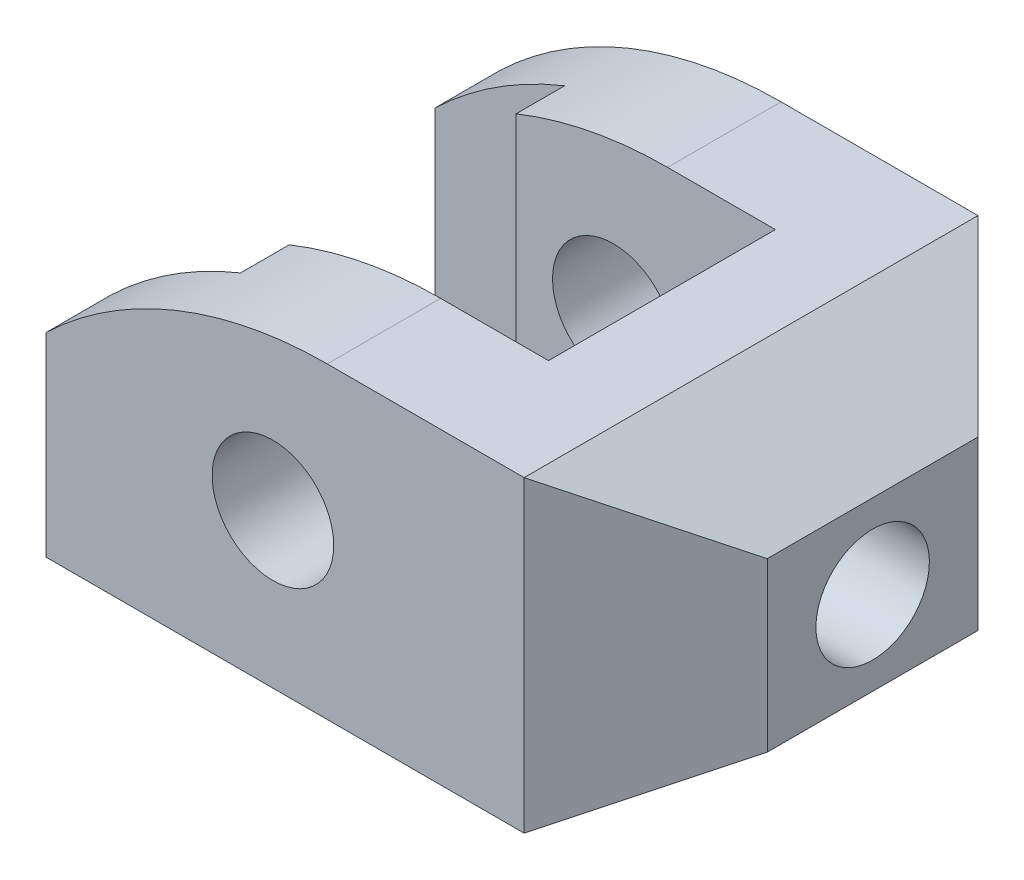
ISO-10303-21;
HEADER;
FILE_DESCRIPTION(('STEP AP214'),'2;1');
FILE_NAME('part.step','',(''),(''),'','','');
FILE_SCHEMA(('AUTOMOTIVE_DESIGN { 1 0 10303 214 1 1 1 1 }'));
ENDSEC;
DATA;
#1=APPLICATION_CONTEXT('core data for automotive mechanical design processes');
#2=APPLICATION_PROTOCOL_DEFINITION('international standard','automotive_design',2000,#1);
#3=PRODUCT_CONTEXT('',#1,'mechanical');
#4=PRODUCT('Part','Part','',(#3));
#5=PRODUCT_RELATED_PRODUCT_CATEGORY('part','',(#4));
#6=PRODUCT_DEFINITION_FORMATION('','',#4);
#7=PRODUCT_DEFINITION_CONTEXT('part definition',#1,'design');
#8=PRODUCT_DEFINITION('design','',#6,#7);
#9=PRODUCT_DEFINITION_SHAPE('','',#8);
#10=(LENGTH_UNIT() NAMED_UNIT(*) SI_UNIT(.MILLI.,.METRE.));
#11=(NAMED_UNIT(*) PLANE_ANGLE_UNIT() SI_UNIT($,.RADIAN.));
#12=(NAMED_UNIT(*) SI_UNIT($,.STERADIAN.) SOLID_ANGLE_UNIT());
#13=UNCERTAINTY_MEASURE_WITH_UNIT(LENGTH_MEASURE(1.E-05),#10,'distance_accuracy_value','');
#14=(GEOMETRIC_REPRESENTATION_CONTEXT(3) GLOBAL_UNCERTAINTY_ASSIGNED_CONTEXT((#13)) GLOBAL_UNIT_ASSIGNED_CONTEXT((#10,
#11,#12)) REPRESENTATION_CONTEXT('',''));
#15=CARTESIAN_POINT('',(0.,0.,0.));
#16=DIRECTION('',(0.,0.,1.));
#17=DIRECTION('',(1.,0.,0.));
#18=AXIS2_PLACEMENT_3D('',#15,#16,#17);
#19=CARTESIAN_POINT('',(-28.,-19.,56.));
#20=DIRECTION('',(1.,0.,0.));
#21=DIRECTION('',(0.,0.,-1.));
#22=AXIS2_PLACEMENT_3D('',#19,#20,#21);
#23=PLANE('',#22);
#24=DIRECTION('',(0.,0.,-1.));
#25=VECTOR('',#24,1.);
#26=CARTESIAN_POINT('',(-28.,-19.,56.));
#27=LINE('',#26,#25);
#28=CARTESIAN_POINT('',(-28.,-19.,8.));
#29=VERTEX_POINT('',#28);
#30=CARTESIAN_POINT('',(-28.,-19.,0.));
#31=VERTEX_POINT('',#30);
#32=EDGE_CURVE('E187',#29,#31,#27,.T.);
#33=ORIENTED_EDGE('',*,*,#32,.F.);
#34=DIRECTION('',(0.,1.,0.));
#35=VECTOR('',#34,1.);
#36=CARTESIAN_POINT('',(-28.,-81.4819974072532,8.));
#37=LINE('',#36,#35);
#38=CARTESIAN_POINT('',(-28.,5.,8.));
#39=VERTEX_POINT('',#38);
#40=EDGE_CURVE('E273',#29,#39,#37,.T.);
#41=ORIENTED_EDGE('',*,*,#40,.T.);
#42=DIRECTION('',(0.,0.,-1.));
#43=VECTOR('',#42,1.);
#44=CARTESIAN_POINT('',(-28.,4.99999999999999,56.));
#45=LINE('',#44,#43);
#46=CARTESIAN_POINT('',(-28.,4.99999999999999,0.));
#47=VERTEX_POINT('',#46);
#48=EDGE_CURVE('E252',#39,#47,#45,.T.);
#49=ORIENTED_EDGE('',*,*,#48,.T.);
#50=DIRECTION('',(0.,-1.,0.));
#51=VECTOR('',#50,1.);
#52=CARTESIAN_POINT('',(-28.,-19.,0.));
#53=LINE('',#52,#51);
#54=EDGE_CURVE('E244',#47,#31,#53,.T.);
#55=ORIENTED_EDGE('',*,*,#54,.T.);
#56=EDGE_LOOP('',(#33,#41,#49,#55));
#57=FACE_BOUND('',#56,.T.);
#58=ADVANCED_FACE('F40',(#57),#23,.F.);
#59=CARTESIAN_POINT('',(6.69870314579494,-31.,56.));
#60=DIRECTION('',(0.,0.,-1.));
#61=DIRECTION('',(-1.,0.,0.));
#62=AXIS2_PLACEMENT_3D('',#59,#60,#61);
#63=CYLINDRICAL_SURFACE('',#62,50.);
#64=ORIENTED_EDGE('',*,*,#48,.F.);
#65=CARTESIAN_POINT('',(6.69870314579494,-31.,8.));
#66=DIRECTION('',(0.,0.,-1.));
#67=DIRECTION('',(-1.,0.,0.));
#68=AXIS2_PLACEMENT_3D('',#65,#66,#67);
#69=CIRCLE('',#68,50.);
#70=CARTESIAN_POINT('',(-12.,15.3719581284362,8.));
#71=VERTEX_POINT('',#70);
#72=EDGE_CURVE('E212',#39,#71,#69,.T.);
#73=ORIENTED_EDGE('',*,*,#72,.T.);
#74=DIRECTION('',(0.,0.,-1.));
#75=VECTOR('',#74,1.);
#76=CARTESIAN_POINT('',(-12.,15.3719581284362,56.));
#77=LINE('',#76,#75);
#78=CARTESIAN_POINT('',(-12.,15.3719581284362,14.));
#79=VERTEX_POINT('',#78);
#80=EDGE_CURVE('E209',#71,#79,#77,.F.);
#81=ORIENTED_EDGE('',*,*,#80,.T.);
#82=CARTESIAN_POINT('',(6.69870314579494,-31.,14.));
#83=DIRECTION('',(0.,0.,-1.));
#84=DIRECTION('',(-1.,0.,0.));
#85=AXIS2_PLACEMENT_3D('',#82,#83,#84);
#86=CIRCLE('',#85,50.);
#87=CARTESIAN_POINT('',(6.69870314579496,19.,14.));
#88=VERTEX_POINT('',#87);
#89=EDGE_CURVE('E204',#79,#88,#86,.T.);
#90=ORIENTED_EDGE('',*,*,#89,.T.);
#91=DIRECTION('',(0.,0.,-1.));
#92=VECTOR('',#91,1.);
#93=CARTESIAN_POINT('',(6.69870314579495,19.,56.));
#94=LINE('',#93,#92);
#95=CARTESIAN_POINT('',(6.69870314579495,19.,0.));
#96=VERTEX_POINT('',#95);
#97=EDGE_CURVE('E251',#88,#96,#94,.T.);
#98=ORIENTED_EDGE('',*,*,#97,.T.);
#99=CARTESIAN_POINT('',(6.69870314579494,-31.,0.));
#100=DIRECTION('',(0.,0.,1.));
#101=DIRECTION('',(1.,0.,0.));
#102=AXIS2_PLACEMENT_3D('',#99,#100,#101);
#103=CIRCLE('',#102,50.);
#104=EDGE_CURVE('E241',#96,#47,#103,.T.);
#105=ORIENTED_EDGE('',*,*,#104,.T.);
#106=EDGE_LOOP('',(#64,#73,#81,#90,#98,#105));
#107=FACE_BOUND('',#106,.T.);
#108=ADVANCED_FACE('F260',(#107),#63,.T.);
#109=CARTESIAN_POINT('',(0.,0.,56.));
#110=DIRECTION('',(0.,0.,-1.));
#111=DIRECTION('',(-1.,0.,0.));
#112=AXIS2_PLACEMENT_3D('',#109,#110,#111);
#113=CYLINDRICAL_SURFACE('',#112,7.5);
#114=CARTESIAN_POINT('',(0.,0.,14.));
#115=DIRECTION('',(0.,0.,-1.));
#116=DIRECTION('',(-1.,0.,0.));
#117=AXIS2_PLACEMENT_3D('',#114,#115,#116);
#118=CIRCLE('',#117,7.5);
#119=CARTESIAN_POINT('',(-7.5,0.,14.));
#120=VERTEX_POINT('',#119);
#121=EDGE_CURVE('E201',#120,#120,#118,.T.);
#122=ORIENTED_EDGE('',*,*,#121,.F.);
#123=EDGE_LOOP('',(#122));
#124=FACE_BOUND('',#123,.T.);
#125=CARTESIAN_POINT('',(0.,0.,0.));
#126=DIRECTION('',(0.,0.,1.));
#127=DIRECTION('',(1.,0.,0.));
#128=AXIS2_PLACEMENT_3D('',#125,#126,#127);
#129=CIRCLE('',#128,7.5);
#130=CARTESIAN_POINT('',(7.5,0.,0.));
#131=VERTEX_POINT('',#130);
#132=EDGE_CURVE('E168',#131,#131,#129,.T.);
#133=ORIENTED_EDGE('',*,*,#132,.F.);
#134=EDGE_LOOP('',(#133));
#135=FACE_BOUND('',#134,.T.);
#136=ADVANCED_FACE('F361',(#124,#135),#113,.F.);
#137=CARTESIAN_POINT('',(6.69870314579494,-31.,56.));
#138=DIRECTION('',(0.,0.,1.));
#139=DIRECTION('',(1.,0.,0.));
#140=AXIS2_PLACEMENT_3D('',#137,#138,#139);
#141=PLANE('',#140);
#142=DIRECTION('',(0.,1.,0.));
#143=VECTOR('',#142,1.);
#144=CARTESIAN_POINT('',(31.,-81.4819974072532,56.));
#145=LINE('',#144,#143);
#146=CARTESIAN_POINT('',(31.,-19.,56.));
#147=VERTEX_POINT('',#146);
#148=CARTESIAN_POINT('',(31.,19.,56.));
#149=VERTEX_POINT('',#148);
#150=EDGE_CURVE('E150',#147,#149,#145,.T.);
#151=ORIENTED_EDGE('',*,*,#150,.T.);
#152=DIRECTION('',(-1.,0.,0.));
#153=VECTOR('',#152,1.);
#154=CARTESIAN_POINT('',(6.69870314579495,19.,56.));
#155=LINE('',#154,#153);
#156=CARTESIAN_POINT('',(6.69870314579495,19.,56.));
#157=VERTEX_POINT('',#156);
#158=EDGE_CURVE('E180',#149,#157,#155,.T.);
#159=ORIENTED_EDGE('',*,*,#158,.T.);
#160=CARTESIAN_POINT('',(6.69870314579494,-31.,56.));
#161=DIRECTION('',(0.,0.,1.));
#162=DIRECTION('',(1.,0.,0.));
#163=AXIS2_PLACEMENT_3D('',#160,#161,#162);
#164=CIRCLE('',#163,50.);
#165=CARTESIAN_POINT('',(-28.,4.99999999999999,56.));
#166=VERTEX_POINT('',#165);
#167=EDGE_CURVE('E302',#157,#166,#164,.T.);
#168=ORIENTED_EDGE('',*,*,#167,.T.);
#169=DIRECTION('',(0.,-1.,0.));
#170=VECTOR('',#169,1.);
#171=CARTESIAN_POINT('',(-28.,-19.,56.));
#172=LINE('',#171,#170);
#173=CARTESIAN_POINT('',(-28.,-19.,56.));
#174=VERTEX_POINT('',#173);
#175=EDGE_CURVE('E176',#166,#174,#172,.T.);
#176=ORIENTED_EDGE('',*,*,#175,.T.);
#177=DIRECTION('',(1.,0.,0.));
#178=VECTOR('',#177,1.);
#179=CARTESIAN_POINT('',(-28.,-19.,56.));
#180=LINE('',#179,#178);
#181=EDGE_CURVE('E172',#174,#147,#180,.T.);
#182=ORIENTED_EDGE('',*,*,#181,.T.);
#183=EDGE_LOOP('',(#151,#159,#168,#176,#182));
#184=FACE_BOUND('',#183,.T.);
#185=CARTESIAN_POINT('',(0.,0.,56.));
#186=DIRECTION('',(0.,0.,1.));
#187=DIRECTION('',(1.,0.,0.));
#188=AXIS2_PLACEMENT_3D('',#185,#186,#187);
#189=CIRCLE('',#188,7.5);
#190=CARTESIAN_POINT('',(7.5,0.,56.));
#191=VERTEX_POINT('',#190);
#192=EDGE_CURVE('E295',#191,#191,#189,.T.);
#193=ORIENTED_EDGE('',*,*,#192,.F.);
#194=EDGE_LOOP('',(#193));
#195=FACE_BOUND('',#194,.T.);
#196=ADVANCED_FACE('F173',(#184,#195),#141,.T.);
#197=CARTESIAN_POINT('',(6.69870314579494,-31.,0.));
#198=DIRECTION('',(0.,0.,1.));
#199=DIRECTION('',(1.,0.,0.));
#200=AXIS2_PLACEMENT_3D('',#197,#198,#199);
#201=PLANE('',#200);
#202=DIRECTION('',(-1.,0.,0.));
#203=VECTOR('',#202,1.);
#204=CARTESIAN_POINT('',(6.69870314579495,19.,0.));
#205=LINE('',#204,#203);
#206=CARTESIAN_POINT('',(31.,19.,0.));
#207=VERTEX_POINT('',#206);
#208=EDGE_CURVE('E229',#207,#96,#205,.T.);
#209=ORIENTED_EDGE('',*,*,#208,.F.);
#210=DIRECTION('',(0.,1.,0.));
#211=VECTOR('',#210,1.);
#212=CARTESIAN_POINT('',(31.,-81.4819974072532,0.));
#213=LINE('',#212,#211);
#214=CARTESIAN_POINT('',(31.,-19.,0.));
#215=VERTEX_POINT('',#214);
#216=EDGE_CURVE('E238',#215,#207,#213,.T.);
#217=ORIENTED_EDGE('',*,*,#216,.F.);
#218=DIRECTION('',(1.,0.,0.));
#219=VECTOR('',#218,1.);
#220=CARTESIAN_POINT('',(-28.,-19.,0.));
#221=LINE('',#220,#219);
#222=EDGE_CURVE('E186',#31,#215,#221,.T.);
#223=ORIENTED_EDGE('',*,*,#222,.F.);
#224=ORIENTED_EDGE('',*,*,#54,.F.);
#225=ORIENTED_EDGE('',*,*,#104,.F.);
#226=EDGE_LOOP('',(#209,#217,#223,#224,#225));
#227=FACE_BOUND('',#226,.T.);
#228=ORIENTED_EDGE('',*,*,#132,.T.);
#229=EDGE_LOOP('',(#228));
#230=FACE_BOUND('',#229,.T.);
#231=ADVANCED_FACE('F236',(#227,#230),#201,.F.);
#232=CARTESIAN_POINT('',(-28.,4.99999999999999,48.));
#233=VERTEX_POINT('',#232);
#234=EDGE_CURVE('E248',#166,#233,#45,.T.);
#235=ORIENTED_EDGE('',*,*,#234,.T.);
#236=DIRECTION('',(0.,1.,0.));
#237=VECTOR('',#236,1.);
#238=CARTESIAN_POINT('',(-28.,-81.4819974072532,48.));
#239=LINE('',#238,#237);
#240=CARTESIAN_POINT('',(-28.,-19.,48.));
#241=VERTEX_POINT('',#240);
#242=EDGE_CURVE('E62',#241,#233,#239,.T.);
#243=ORIENTED_EDGE('',*,*,#242,.F.);
#244=EDGE_CURVE('E189',#174,#241,#27,.T.);
#245=ORIENTED_EDGE('',*,*,#244,.F.);
#246=ORIENTED_EDGE('',*,*,#175,.F.);
#247=EDGE_LOOP('',(#235,#243,#245,#246));
#248=FACE_BOUND('',#247,.T.);
#249=ADVANCED_FACE('F42',(#248),#23,.F.);
#250=CARTESIAN_POINT('',(-28.,-19.,56.));
#251=DIRECTION('',(0.,1.,0.));
#252=DIRECTION('',(0.,0.,1.));
#253=AXIS2_PLACEMENT_3D('',#250,#251,#252);
#254=PLANE('',#253);
#255=DIRECTION('',(0.,0.,1.));
#256=VECTOR('',#255,1.);
#257=CARTESIAN_POINT('',(-12.,-19.,8.));
#258=LINE('',#257,#256);
#259=CARTESIAN_POINT('',(-12.,-19.,8.));
#260=VERTEX_POINT('',#259);
#261=CARTESIAN_POINT('',(-12.,-19.,14.));
#262=VERTEX_POINT('',#261);
#263=EDGE_CURVE('E279',#260,#262,#258,.T.);
#264=ORIENTED_EDGE('',*,*,#263,.F.);
#265=DIRECTION('',(1.,0.,0.));
#266=VECTOR('',#265,1.);
#267=CARTESIAN_POINT('',(-28.,-19.,8.));
#268=LINE('',#267,#266);
#269=EDGE_CURVE('E277',#29,#260,#268,.T.);
#270=ORIENTED_EDGE('',*,*,#269,.F.);
#271=ORIENTED_EDGE('',*,*,#32,.T.);
#272=ORIENTED_EDGE('',*,*,#222,.T.);
#273=DIRECTION('',(0.,0.,-1.));
#274=VECTOR('',#273,1.);
#275=CARTESIAN_POINT('',(31.,-19.,56.));
#276=LINE('',#275,#274);
#277=EDGE_CURVE('E165',#147,#215,#276,.T.);
#278=ORIENTED_EDGE('',*,*,#277,.F.);
#279=ORIENTED_EDGE('',*,*,#181,.F.);
#280=ORIENTED_EDGE('',*,*,#244,.T.);
#281=DIRECTION('',(-1.,0.,0.));
#282=VECTOR('',#281,1.);
#283=CARTESIAN_POINT('',(-28.,-19.,48.));
#284=LINE('',#283,#282);
#285=CARTESIAN_POINT('',(-12.,-19.,48.));
#286=VERTEX_POINT('',#285);
#287=EDGE_CURVE('E280',#286,#241,#284,.T.);
#288=ORIENTED_EDGE('',*,*,#287,.F.);
#289=DIRECTION('',(0.,0.,1.));
#290=VECTOR('',#289,1.);
#291=CARTESIAN_POINT('',(-12.,-19.,48.));
#292=LINE('',#291,#290);
#293=CARTESIAN_POINT('',(-12.,-19.,42.));
#294=VERTEX_POINT('',#293);
#295=EDGE_CURVE('E288',#294,#286,#292,.T.);
#296=ORIENTED_EDGE('',*,*,#295,.F.);
#297=DIRECTION('',(-1.,0.,0.));
#298=VECTOR('',#297,1.);
#299=CARTESIAN_POINT('',(-12.,-19.,42.));
#300=LINE('',#299,#298);
#301=CARTESIAN_POINT('',(20.,-19.,42.));
#302=VERTEX_POINT('',#301);
#303=EDGE_CURVE('E286',#302,#294,#300,.T.);
#304=ORIENTED_EDGE('',*,*,#303,.F.);
#305=DIRECTION('',(0.,0.,1.));
#306=VECTOR('',#305,1.);
#307=CARTESIAN_POINT('',(20.,-19.,14.));
#308=LINE('',#307,#306);
#309=CARTESIAN_POINT('',(20.,-19.,14.));
#310=VERTEX_POINT('',#309);
#311=EDGE_CURVE('E284',#310,#302,#308,.T.);
#312=ORIENTED_EDGE('',*,*,#311,.F.);
#313=DIRECTION('',(1.,0.,0.));
#314=VECTOR('',#313,1.);
#315=CARTESIAN_POINT('',(-12.,-19.,14.));
#316=LINE('',#315,#314);
#317=EDGE_CURVE('E282',#262,#310,#316,.T.);
#318=ORIENTED_EDGE('',*,*,#317,.F.);
#319=EDGE_LOOP('',(#264,#270,#271,#272,#278,#279,#280,#288,#296,#304,#312,#318));
#320=FACE_BOUND('',#319,.T.);
#321=ADVANCED_FACE('F184',(#320),#254,.F.);
#322=CARTESIAN_POINT('',(31.,-19.,56.));
#323=DIRECTION('',(-0.500000000000001,0.866025403784438,0.));
#324=DIRECTION('',(-0.866025403784438,-0.500000000000001,0.));
#325=AXIS2_PLACEMENT_3D('',#322,#323,#324);
#326=PLANE('',#325);
#327=DIRECTION('',(0.,0.,-1.));
#328=VECTOR('',#327,1.);
#329=CARTESIAN_POINT('',(46.,-10.3397459621556,56.));
#330=LINE('',#329,#328);
#331=CARTESIAN_POINT('',(46.,-10.3397459621556,41.0000000000002));
#332=VERTEX_POINT('',#331);
#333=CARTESIAN_POINT('',(46.,-10.3397459621556,14.9999999999998));
#334=VERTEX_POINT('',#333);
#335=EDGE_CURVE('E167',#332,#334,#330,.T.);
#336=ORIENTED_EDGE('',*,*,#335,.F.);
#337=DIRECTION('',(-0.65465367070798,-0.37796447300923,0.654653670707973));
#338=VECTOR('',#337,1.);
#339=CARTESIAN_POINT('',(31.,-19.,56.));
#340=LINE('',#339,#338);
#341=EDGE_CURVE('E153',#332,#147,#340,.T.);
#342=ORIENTED_EDGE('',*,*,#341,.T.);
#343=ORIENTED_EDGE('',*,*,#277,.T.);
#344=DIRECTION('',(0.65465367070798,0.37796447300923,0.654653670707973));
#345=VECTOR('',#344,1.);
#346=CARTESIAN_POINT('',(54.9999999999999,-5.14359353944897,23.9999999999997));
#347=LINE('',#346,#345);
#348=EDGE_CURVE('E169',#215,#334,#347,.T.);
#349=ORIENTED_EDGE('',*,*,#348,.T.);
#350=EDGE_LOOP('',(#336,#342,#343,#349));
#351=FACE_BOUND('',#350,.T.);
#352=ADVANCED_FACE('F162',(#351),#326,.F.);
#353=CARTESIAN_POINT('',(46.,10.3397459621556,56.));
#354=DIRECTION('',(-1.,0.,0.));
#355=DIRECTION('',(0.,0.,1.));
#356=AXIS2_PLACEMENT_3D('',#353,#354,#355);
#357=PLANE('',#356);
#358=CARTESIAN_POINT('',(46.,0.,28.));
#359=DIRECTION('',(1.,0.,0.));
#360=DIRECTION('',(0.,0.,-1.));
#361=AXIS2_PLACEMENT_3D('',#358,#359,#360);
#362=CIRCLE('',#361,7.);
#363=CARTESIAN_POINT('',(46.,0.,21.));
#364=VERTEX_POINT('',#363);
#365=EDGE_CURVE('E333',#364,#364,#362,.T.);
#366=ORIENTED_EDGE('',*,*,#365,.F.);
#367=EDGE_LOOP('',(#366));
#368=FACE_BOUND('',#367,.T.);
#369=DIRECTION('',(0.,0.,-1.));
#370=VECTOR('',#369,1.);
#371=CARTESIAN_POINT('',(46.,10.3397459621556,56.));
#372=LINE('',#371,#370);
#373=CARTESIAN_POINT('',(46.,10.3397459621556,41.0000000000002));
#374=VERTEX_POINT('',#373);
#375=CARTESIAN_POINT('',(46.,10.3397459621556,14.9999999999998));
#376=VERTEX_POINT('',#375);
#377=EDGE_CURVE('E191',#374,#376,#372,.T.);
#378=ORIENTED_EDGE('',*,*,#377,.F.);
#379=DIRECTION('',(0.,1.,0.));
#380=VECTOR('',#379,1.);
#381=CARTESIAN_POINT('',(46.,-81.4819974072532,41.0000000000002));
#382=LINE('',#381,#380);
#383=EDGE_CURVE('E55',#332,#374,#382,.T.);
#384=ORIENTED_EDGE('',*,*,#383,.F.);
#385=ORIENTED_EDGE('',*,*,#335,.T.);
#386=DIRECTION('',(0.,1.,0.));
#387=VECTOR('',#386,1.);
#388=CARTESIAN_POINT('',(46.,-81.4819974072532,14.9999999999998));
#389=LINE('',#388,#387);
#390=EDGE_CURVE('E200',#334,#376,#389,.T.);
#391=ORIENTED_EDGE('',*,*,#390,.T.);
#392=EDGE_LOOP('',(#378,#384,#385,#391));
#393=FACE_BOUND('',#392,.T.);
#394=ADVANCED_FACE('F339',(#368,#393),#357,.F.);
#395=CARTESIAN_POINT('',(31.,19.,56.));
#396=DIRECTION('',(-0.500000000000001,-0.866025403784438,0.));
#397=DIRECTION('',(0.866025403784438,-0.500000000000001,0.));
#398=AXIS2_PLACEMENT_3D('',#395,#396,#397);
#399=PLANE('',#398);
#400=DIRECTION('',(0.,0.,-1.));
#401=VECTOR('',#400,1.);
#402=CARTESIAN_POINT('',(31.,19.,56.));
#403=LINE('',#402,#401);
#404=EDGE_CURVE('E219',#149,#207,#403,.T.);
#405=ORIENTED_EDGE('',*,*,#404,.F.);
#406=DIRECTION('',(0.65465367070798,-0.37796447300923,-0.654653670707973));
#407=VECTOR('',#406,1.);
#408=CARTESIAN_POINT('',(31.,19.,56.));
#409=LINE('',#408,#407);
#410=EDGE_CURVE('E11',#149,#374,#409,.T.);
#411=ORIENTED_EDGE('',*,*,#410,.T.);
#412=ORIENTED_EDGE('',*,*,#377,.T.);
#413=DIRECTION('',(-0.65465367070798,0.37796447300923,-0.654653670707973));
#414=VECTOR('',#413,1.);
#415=CARTESIAN_POINT('',(54.9999999999999,5.14359353944898,23.9999999999997));
#416=LINE('',#415,#414);
#417=EDGE_CURVE('E48',#376,#207,#416,.T.);
#418=ORIENTED_EDGE('',*,*,#417,.T.);
#419=EDGE_LOOP('',(#405,#411,#412,#418));
#420=FACE_BOUND('',#419,.T.);
#421=ADVANCED_FACE('F218',(#420),#399,.F.);
#422=CARTESIAN_POINT('',(6.69870314579495,19.,56.));
#423=DIRECTION('',(0.,-1.,0.));
#424=DIRECTION('',(1.,0.,0.));
#425=AXIS2_PLACEMENT_3D('',#422,#423,#424);
#426=PLANE('',#425);
#427=ORIENTED_EDGE('',*,*,#97,.F.);
#428=DIRECTION('',(-1.,0.,0.));
#429=VECTOR('',#428,1.);
#430=CARTESIAN_POINT('',(-12.,19.,14.));
#431=LINE('',#430,#429);
#432=CARTESIAN_POINT('',(20.,19.,14.));
#433=VERTEX_POINT('',#432);
#434=EDGE_CURVE('E263',#433,#88,#431,.T.);
#435=ORIENTED_EDGE('',*,*,#434,.F.);
#436=DIRECTION('',(0.,0.,-1.));
#437=VECTOR('',#436,1.);
#438=CARTESIAN_POINT('',(20.,19.,14.));
#439=LINE('',#438,#437);
#440=CARTESIAN_POINT('',(20.,19.,42.));
#441=VERTEX_POINT('',#440);
#442=EDGE_CURVE('E266',#441,#433,#439,.T.);
#443=ORIENTED_EDGE('',*,*,#442,.F.);
#444=DIRECTION('',(1.,0.,0.));
#445=VECTOR('',#444,1.);
#446=CARTESIAN_POINT('',(-12.,19.,42.));
#447=LINE('',#446,#445);
#448=CARTESIAN_POINT('',(6.69870314579496,19.,42.));
#449=VERTEX_POINT('',#448);
#450=EDGE_CURVE('E157',#449,#441,#447,.T.);
#451=ORIENTED_EDGE('',*,*,#450,.F.);
#452=EDGE_CURVE('E232',#157,#449,#94,.T.);
#453=ORIENTED_EDGE('',*,*,#452,.F.);
#454=ORIENTED_EDGE('',*,*,#158,.F.);
#455=ORIENTED_EDGE('',*,*,#404,.T.);
#456=ORIENTED_EDGE('',*,*,#208,.T.);
#457=EDGE_LOOP('',(#427,#435,#443,#451,#453,#454,#455,#456));
#458=FACE_BOUND('',#457,.T.);
#459=ADVANCED_FACE('F228',(#458),#426,.F.);
#460=ORIENTED_EDGE('',*,*,#452,.T.);
#461=CARTESIAN_POINT('',(6.69870314579494,-31.,42.));
#462=DIRECTION('',(0.,0.,1.));
#463=DIRECTION('',(1.,0.,0.));
#464=AXIS2_PLACEMENT_3D('',#461,#462,#463);
#465=CIRCLE('',#464,50.);
#466=CARTESIAN_POINT('',(-12.,15.3719581284362,42.));
#467=VERTEX_POINT('',#466);
#468=EDGE_CURVE('E199',#449,#467,#465,.T.);
#469=ORIENTED_EDGE('',*,*,#468,.T.);
#470=DIRECTION('',(0.,0.,-1.));
#471=VECTOR('',#470,1.);
#472=CARTESIAN_POINT('',(-12.,15.3719581284362,56.));
#473=LINE('',#472,#471);
#474=CARTESIAN_POINT('',(-12.,15.3719581284362,48.));
#475=VERTEX_POINT('',#474);
#476=EDGE_CURVE('E206',#467,#475,#473,.F.);
#477=ORIENTED_EDGE('',*,*,#476,.T.);
#478=CARTESIAN_POINT('',(6.69870314579494,-31.,48.));
#479=DIRECTION('',(0.,0.,1.));
#480=DIRECTION('',(1.,0.,0.));
#481=AXIS2_PLACEMENT_3D('',#478,#479,#480);
#482=CIRCLE('',#481,50.);
#483=EDGE_CURVE('E195',#475,#233,#482,.T.);
#484=ORIENTED_EDGE('',*,*,#483,.T.);
#485=ORIENTED_EDGE('',*,*,#234,.F.);
#486=ORIENTED_EDGE('',*,*,#167,.F.);
#487=EDGE_LOOP('',(#460,#469,#477,#484,#485,#486));
#488=FACE_BOUND('',#487,.T.);
#489=ADVANCED_FACE('F363',(#488),#63,.T.);
#490=CARTESIAN_POINT('',(0.,0.,42.));
#491=DIRECTION('',(0.,0.,1.));
#492=DIRECTION('',(1.,0.,0.));
#493=AXIS2_PLACEMENT_3D('',#490,#491,#492);
#494=CIRCLE('',#493,7.5);
#495=CARTESIAN_POINT('',(7.5,0.,42.));
#496=VERTEX_POINT('',#495);
#497=EDGE_CURVE('E196',#496,#496,#494,.T.);
#498=ORIENTED_EDGE('',*,*,#497,.F.);
#499=EDGE_LOOP('',(#498));
#500=FACE_BOUND('',#499,.T.);
#501=ORIENTED_EDGE('',*,*,#192,.T.);
#502=EDGE_LOOP('',(#501));
#503=FACE_BOUND('',#502,.T.);
#504=ADVANCED_FACE('F396',(#500,#503),#113,.F.);
#505=CARTESIAN_POINT('',(-28.,-81.4819974072532,8.));
#506=DIRECTION('',(0.,0.,-1.));
#507=DIRECTION('',(-1.,0.,0.));
#508=AXIS2_PLACEMENT_3D('',#505,#506,#507);
#509=PLANE('',#508);
#510=ORIENTED_EDGE('',*,*,#40,.F.);
#511=ORIENTED_EDGE('',*,*,#269,.T.);
#512=DIRECTION('',(0.,1.,0.));
#513=VECTOR('',#512,1.);
#514=CARTESIAN_POINT('',(-12.,-81.4819974072532,8.));
#515=LINE('',#514,#513);
#516=EDGE_CURVE('E312',#260,#71,#515,.T.);
#517=ORIENTED_EDGE('',*,*,#516,.T.);
#518=ORIENTED_EDGE('',*,*,#72,.F.);
#519=EDGE_LOOP('',(#510,#511,#517,#518));
#520=FACE_BOUND('',#519,.T.);
#521=ADVANCED_FACE('F309',(#520),#509,.F.);
#522=CARTESIAN_POINT('',(-12.,-81.4819974072532,8.));
#523=DIRECTION('',(1.,0.,0.));
#524=DIRECTION('',(0.,1.,0.));
#525=AXIS2_PLACEMENT_3D('',#522,#523,#524);
#526=PLANE('',#525);
#527=ORIENTED_EDGE('',*,*,#516,.F.);
#528=ORIENTED_EDGE('',*,*,#263,.T.);
#529=DIRECTION('',(0.,1.,0.));
#530=VECTOR('',#529,1.);
#531=CARTESIAN_POINT('',(-12.,-81.4819974072532,14.));
#532=LINE('',#531,#530);
#533=EDGE_CURVE('E314',#262,#79,#532,.T.);
#534=ORIENTED_EDGE('',*,*,#533,.T.);
#535=ORIENTED_EDGE('',*,*,#80,.F.);
#536=EDGE_LOOP('',(#527,#528,#534,#535));
#537=FACE_BOUND('',#536,.T.);
#538=ADVANCED_FACE('F388',(#537),#526,.F.);
#539=CARTESIAN_POINT('',(-12.,-81.4819974072532,48.));
#540=DIRECTION('',(1.,0.,0.));
#541=DIRECTION('',(0.,1.,0.));
#542=AXIS2_PLACEMENT_3D('',#539,#540,#541);
#543=PLANE('',#542);
#544=DIRECTION('',(0.,1.,0.));
#545=VECTOR('',#544,1.);
#546=CARTESIAN_POINT('',(-12.,-81.4819974072532,42.));
#547=LINE('',#546,#545);
#548=EDGE_CURVE('E323',#294,#467,#547,.T.);
#549=ORIENTED_EDGE('',*,*,#548,.F.);
#550=ORIENTED_EDGE('',*,*,#295,.T.);
#551=DIRECTION('',(0.,1.,0.));
#552=VECTOR('',#551,1.);
#553=CARTESIAN_POINT('',(-12.,-81.4819974072532,48.));
#554=LINE('',#553,#552);
#555=EDGE_CURVE('E270',#286,#475,#554,.T.);
#556=ORIENTED_EDGE('',*,*,#555,.T.);
#557=ORIENTED_EDGE('',*,*,#476,.F.);
#558=EDGE_LOOP('',(#549,#550,#556,#557));
#559=FACE_BOUND('',#558,.T.);
#560=ADVANCED_FACE('F377',(#559),#543,.F.);
#561=CARTESIAN_POINT('',(-28.,-81.4819974072532,48.));
#562=DIRECTION('',(0.,0.,1.));
#563=DIRECTION('',(1.,0.,0.));
#564=AXIS2_PLACEMENT_3D('',#561,#562,#563);
#565=PLANE('',#564);
#566=ORIENTED_EDGE('',*,*,#555,.F.);
#567=ORIENTED_EDGE('',*,*,#287,.T.);
#568=ORIENTED_EDGE('',*,*,#242,.T.);
#569=ORIENTED_EDGE('',*,*,#483,.F.);
#570=EDGE_LOOP('',(#566,#567,#568,#569));
#571=FACE_BOUND('',#570,.T.);
#572=ADVANCED_FACE('F373',(#571),#565,.F.);
#573=CARTESIAN_POINT('',(-12.,-81.4819974072532,14.));
#574=DIRECTION('',(0.,0.,-1.));
#575=DIRECTION('',(-1.,0.,0.));
#576=AXIS2_PLACEMENT_3D('',#573,#574,#575);
#577=PLANE('',#576);
#578=ORIENTED_EDGE('',*,*,#121,.T.);
#579=EDGE_LOOP('',(#578));
#580=FACE_BOUND('',#579,.T.);
#581=ORIENTED_EDGE('',*,*,#533,.F.);
#582=ORIENTED_EDGE('',*,*,#317,.T.);
#583=DIRECTION('',(0.,1.,0.));
#584=VECTOR('',#583,1.);
#585=CARTESIAN_POINT('',(20.,-81.4819974072532,14.));
#586=LINE('',#585,#584);
#587=EDGE_CURVE('E316',#310,#433,#586,.T.);
#588=ORIENTED_EDGE('',*,*,#587,.T.);
#589=ORIENTED_EDGE('',*,*,#434,.T.);
#590=ORIENTED_EDGE('',*,*,#89,.F.);
#591=EDGE_LOOP('',(#581,#582,#588,#589,#590));
#592=FACE_BOUND('',#591,.T.);
#593=ADVANCED_FACE('F387',(#580,#592),#577,.F.);
#594=CARTESIAN_POINT('',(-12.,-81.4819974072532,42.));
#595=DIRECTION('',(0.,0.,1.));
#596=DIRECTION('',(1.,0.,0.));
#597=AXIS2_PLACEMENT_3D('',#594,#595,#596);
#598=PLANE('',#597);
#599=ORIENTED_EDGE('',*,*,#497,.T.);
#600=EDGE_LOOP('',(#599));
#601=FACE_BOUND('',#600,.T.);
#602=ORIENTED_EDGE('',*,*,#450,.T.);
#603=DIRECTION('',(0.,1.,0.));
#604=VECTOR('',#603,1.);
#605=CARTESIAN_POINT('',(20.,-81.4819974072532,42.));
#606=LINE('',#605,#604);
#607=EDGE_CURVE('E320',#302,#441,#606,.T.);
#608=ORIENTED_EDGE('',*,*,#607,.F.);
#609=ORIENTED_EDGE('',*,*,#303,.T.);
#610=ORIENTED_EDGE('',*,*,#548,.T.);
#611=ORIENTED_EDGE('',*,*,#468,.F.);
#612=EDGE_LOOP('',(#602,#608,#609,#610,#611));
#613=FACE_BOUND('',#612,.T.);
#614=ADVANCED_FACE('F352',(#601,#613),#598,.F.);
#615=CARTESIAN_POINT('',(20.,-81.4819974072532,14.));
#616=DIRECTION('',(1.,0.,0.));
#617=DIRECTION('',(0.,1.,0.));
#618=AXIS2_PLACEMENT_3D('',#615,#616,#617);
#619=PLANE('',#618);
#620=CARTESIAN_POINT('',(20.,0.,28.));
#621=DIRECTION('',(1.,0.,0.));
#622=DIRECTION('',(0.,1.,0.));
#623=AXIS2_PLACEMENT_3D('',#620,#621,#622);
#624=CIRCLE('',#623,7.);
#625=CARTESIAN_POINT('',(20.,7.,28.));
#626=VERTEX_POINT('',#625);
#627=EDGE_CURVE('E328',#626,#626,#624,.F.);
#628=ORIENTED_EDGE('',*,*,#627,.F.);
#629=EDGE_LOOP('',(#628));
#630=FACE_BOUND('',#629,.T.);
#631=ORIENTED_EDGE('',*,*,#311,.T.);
#632=ORIENTED_EDGE('',*,*,#607,.T.);
#633=ORIENTED_EDGE('',*,*,#442,.T.);
#634=ORIENTED_EDGE('',*,*,#587,.F.);
#635=EDGE_LOOP('',(#631,#632,#633,#634));
#636=FACE_BOUND('',#635,.T.);
#637=ADVANCED_FACE('F345',(#630,#636),#619,.F.);
#638=CARTESIAN_POINT('',(31.,-81.4819974072532,0.));
#639=DIRECTION('',(-0.707106781186544,0.,0.707106781186551));
#640=DIRECTION('',(0.707106781186551,0.,0.707106781186544));
#641=AXIS2_PLACEMENT_3D('',#638,#639,#640);
#642=PLANE('',#641);
#643=ORIENTED_EDGE('',*,*,#216,.T.);
#644=ORIENTED_EDGE('',*,*,#417,.F.);
#645=ORIENTED_EDGE('',*,*,#390,.F.);
#646=ORIENTED_EDGE('',*,*,#348,.F.);
#647=EDGE_LOOP('',(#643,#644,#645,#646));
#648=FACE_BOUND('',#647,.T.);
#649=ADVANCED_FACE('F343',(#648),#642,.F.);
#650=CARTESIAN_POINT('',(31.,-81.4819974072532,56.));
#651=DIRECTION('',(-0.707106781186544,0.,-0.707106781186551));
#652=DIRECTION('',(-0.707106781186551,0.,0.707106781186544));
#653=AXIS2_PLACEMENT_3D('',#650,#651,#652);
#654=PLANE('',#653);
#655=ORIENTED_EDGE('',*,*,#383,.T.);
#656=ORIENTED_EDGE('',*,*,#410,.F.);
#657=ORIENTED_EDGE('',*,*,#150,.F.);
#658=ORIENTED_EDGE('',*,*,#341,.F.);
#659=EDGE_LOOP('',(#655,#656,#657,#658));
#660=FACE_BOUND('',#659,.T.);
#661=ADVANCED_FACE('F152',(#660),#654,.F.);
#662=CARTESIAN_POINT('',(0.201010126776667,0.,28.));
#663=DIRECTION('',(1.,0.,0.));
#664=DIRECTION('',(0.,0.,-1.));
#665=AXIS2_PLACEMENT_3D('',#662,#663,#664);
#666=CYLINDRICAL_SURFACE('',#665,7.);
#667=ORIENTED_EDGE('',*,*,#627,.T.);
#668=EDGE_LOOP('',(#667));
#669=FACE_BOUND('',#668,.T.);
#670=ORIENTED_EDGE('',*,*,#365,.T.);
#671=EDGE_LOOP('',(#670));
#672=FACE_BOUND('',#671,.T.);
#673=ADVANCED_FACE('F337',(#669,#672),#666,.F.);
#674=CLOSED_SHELL('',(#58,#108,#136,#196,#231,#249,#321,#352,#394,#421,#459,#489,#504,#521,#538,
#560,#572,#593,#614,#637,#649,#661,#673));
#675=MANIFOLD_SOLID_BREP('B2',#674);
#676=ADVANCED_BREP_SHAPE_REPRESENTATION('',(#18,#675),#14);
#677=SHAPE_DEFINITION_REPRESENTATION(#9,#676);
ENDSEC;
END-ISO-10303-21;
